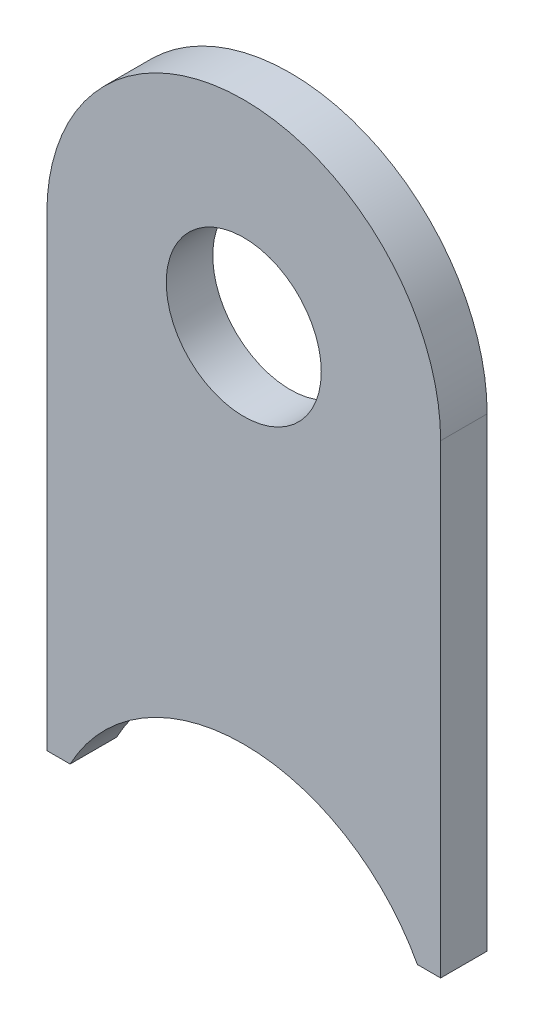
ISO-10303-21;
HEADER;
FILE_DESCRIPTION(('STEP AP214'),'2;1');
FILE_NAME('part.step','',(''),(''),'','','');
FILE_SCHEMA(('AUTOMOTIVE_DESIGN { 1 0 10303 214 1 1 1 1 }'));
ENDSEC;
DATA;
#1=APPLICATION_CONTEXT('core data for automotive mechanical design processes');
#2=APPLICATION_PROTOCOL_DEFINITION('international standard','automotive_design',2000,#1);
#3=PRODUCT_CONTEXT('',#1,'mechanical');
#4=PRODUCT('Part','Part','',(#3));
#5=PRODUCT_RELATED_PRODUCT_CATEGORY('part','',(#4));
#6=PRODUCT_DEFINITION_FORMATION('','',#4);
#7=PRODUCT_DEFINITION_CONTEXT('part definition',#1,'design');
#8=PRODUCT_DEFINITION('design','',#6,#7);
#9=PRODUCT_DEFINITION_SHAPE('','',#8);
#10=(LENGTH_UNIT() NAMED_UNIT(*) SI_UNIT(.MILLI.,.METRE.));
#11=(NAMED_UNIT(*) PLANE_ANGLE_UNIT() SI_UNIT($,.RADIAN.));
#12=(NAMED_UNIT(*) SI_UNIT($,.STERADIAN.) SOLID_ANGLE_UNIT());
#13=UNCERTAINTY_MEASURE_WITH_UNIT(LENGTH_MEASURE(1.E-05),#10,'distance_accuracy_value','');
#14=(GEOMETRIC_REPRESENTATION_CONTEXT(3) GLOBAL_UNCERTAINTY_ASSIGNED_CONTEXT((#13)) GLOBAL_UNIT_ASSIGNED_CONTEXT((#10,
#11,#12)) REPRESENTATION_CONTEXT('',''));
#15=CARTESIAN_POINT('',(0.,0.,0.));
#16=DIRECTION('',(0.,0.,1.));
#17=DIRECTION('',(1.,0.,0.));
#18=AXIS2_PLACEMENT_3D('',#15,#16,#17);
#19=CARTESIAN_POINT('',(0.,0.,-1.5));
#20=DIRECTION('',(0.,0.,1.));
#21=DIRECTION('',(1.,0.,0.));
#22=AXIS2_PLACEMENT_3D('',#19,#20,#21);
#23=CYLINDRICAL_SURFACE('',#22,12.7);
#24=DIRECTION('',(0.,0.,1.));
#25=VECTOR('',#24,1.);
#26=CARTESIAN_POINT('',(-12.7,0.,-1.5));
#27=LINE('',#26,#25);
#28=CARTESIAN_POINT('',(-12.7,0.,-1.5));
#29=VERTEX_POINT('',#28);
#30=CARTESIAN_POINT('',(-12.7,0.,1.5));
#31=VERTEX_POINT('',#30);
#32=EDGE_CURVE('E36',#29,#31,#27,.T.);
#33=ORIENTED_EDGE('',*,*,#32,.T.);
#34=CARTESIAN_POINT('',(0.,0.,1.5));
#35=DIRECTION('',(0.,0.,1.));
#36=DIRECTION('',(-1.,0.,0.));
#37=AXIS2_PLACEMENT_3D('',#34,#35,#36);
#38=CIRCLE('',#37,12.7);
#39=CARTESIAN_POINT('',(12.7,0.,1.5));
#40=VERTEX_POINT('',#39);
#41=EDGE_CURVE('E85',#40,#31,#38,.T.);
#42=ORIENTED_EDGE('',*,*,#41,.F.);
#43=DIRECTION('',(0.,0.,1.));
#44=VECTOR('',#43,1.);
#45=CARTESIAN_POINT('',(12.7,0.,-1.5));
#46=LINE('',#45,#44);
#47=CARTESIAN_POINT('',(12.7,0.,-1.5));
#48=VERTEX_POINT('',#47);
#49=EDGE_CURVE('E12',#48,#40,#46,.T.);
#50=ORIENTED_EDGE('',*,*,#49,.F.);
#51=CARTESIAN_POINT('',(0.,0.,-1.5));
#52=DIRECTION('',(0.,0.,1.));
#53=DIRECTION('',(-1.,0.,0.));
#54=AXIS2_PLACEMENT_3D('',#51,#52,#53);
#55=CIRCLE('',#54,12.7);
#56=EDGE_CURVE('E86',#48,#29,#55,.T.);
#57=ORIENTED_EDGE('',*,*,#56,.T.);
#58=EDGE_LOOP('',(#33,#42,#50,#57));
#59=FACE_BOUND('',#58,.T.);
#60=ADVANCED_FACE('F33',(#59),#23,.T.);
#61=CARTESIAN_POINT('',(12.7,0.,-1.5));
#62=DIRECTION('',(1.,0.,0.));
#63=DIRECTION('',(0.,1.,0.));
#64=AXIS2_PLACEMENT_3D('',#61,#62,#63);
#65=PLANE('',#64);
#66=ORIENTED_EDGE('',*,*,#49,.T.);
#67=DIRECTION('',(0.,1.,0.));
#68=VECTOR('',#67,1.);
#69=CARTESIAN_POINT('',(12.7,0.,1.5));
#70=LINE('',#69,#68);
#71=CARTESIAN_POINT('',(12.7,-30.0125130480309,1.5));
#72=VERTEX_POINT('',#71);
#73=EDGE_CURVE('E104',#72,#40,#70,.T.);
#74=ORIENTED_EDGE('',*,*,#73,.F.);
#75=DIRECTION('',(0.,0.,1.));
#76=VECTOR('',#75,1.);
#77=CARTESIAN_POINT('',(12.7,-30.0125130480309,-1.5));
#78=LINE('',#77,#76);
#79=CARTESIAN_POINT('',(12.7,-30.0125130480309,-1.5));
#80=VERTEX_POINT('',#79);
#81=EDGE_CURVE('E41',#80,#72,#78,.T.);
#82=ORIENTED_EDGE('',*,*,#81,.F.);
#83=DIRECTION('',(0.,1.,0.));
#84=VECTOR('',#83,1.);
#85=CARTESIAN_POINT('',(12.7,0.,-1.5));
#86=LINE('',#85,#84);
#87=EDGE_CURVE('E91',#80,#48,#86,.T.);
#88=ORIENTED_EDGE('',*,*,#87,.T.);
#89=EDGE_LOOP('',(#66,#74,#82,#88));
#90=FACE_BOUND('',#89,.T.);
#91=ADVANCED_FACE('F161',(#90),#65,.T.);
#92=CARTESIAN_POINT('',(11.2,-30.0125130480309,-1.5));
#93=DIRECTION('',(0.,-1.,0.));
#94=DIRECTION('',(0.,0.,-1.));
#95=AXIS2_PLACEMENT_3D('',#92,#93,#94);
#96=PLANE('',#95);
#97=ORIENTED_EDGE('',*,*,#81,.T.);
#98=DIRECTION('',(1.,0.,0.));
#99=VECTOR('',#98,1.);
#100=CARTESIAN_POINT('',(11.2,-30.0125130480309,1.5));
#101=LINE('',#100,#99);
#102=CARTESIAN_POINT('',(11.2,-30.0125130480309,1.5));
#103=VERTEX_POINT('',#102);
#104=EDGE_CURVE('E123',#103,#72,#101,.T.);
#105=ORIENTED_EDGE('',*,*,#104,.F.);
#106=DIRECTION('',(0.,0.,1.));
#107=VECTOR('',#106,1.);
#108=CARTESIAN_POINT('',(11.2,-30.0125130480309,-1.5));
#109=LINE('',#108,#107);
#110=CARTESIAN_POINT('',(11.2,-30.0125130480309,-1.5));
#111=VERTEX_POINT('',#110);
#112=EDGE_CURVE('E144',#111,#103,#109,.T.);
#113=ORIENTED_EDGE('',*,*,#112,.F.);
#114=DIRECTION('',(1.,0.,0.));
#115=VECTOR('',#114,1.);
#116=CARTESIAN_POINT('',(11.2,-30.0125130480309,-1.5));
#117=LINE('',#116,#115);
#118=EDGE_CURVE('E140',#111,#80,#117,.T.);
#119=ORIENTED_EDGE('',*,*,#118,.T.);
#120=EDGE_LOOP('',(#97,#105,#113,#119));
#121=FACE_BOUND('',#120,.T.);
#122=ADVANCED_FACE('F157',(#121),#96,.T.);
#123=CARTESIAN_POINT('',(0.,-36.,-1.5));
#124=DIRECTION('',(0.,0.,1.));
#125=DIRECTION('',(1.,0.,0.));
#126=AXIS2_PLACEMENT_3D('',#123,#124,#125);
#127=CYLINDRICAL_SURFACE('',#126,12.7);
#128=ORIENTED_EDGE('',*,*,#112,.T.);
#129=CARTESIAN_POINT('',(0.,-36.,1.5));
#130=DIRECTION('',(0.,0.,-1.));
#131=DIRECTION('',(-1.,0.,0.));
#132=AXIS2_PLACEMENT_3D('',#129,#130,#131);
#133=CIRCLE('',#132,12.7);
#134=CARTESIAN_POINT('',(-11.2,-30.0125130480309,1.5));
#135=VERTEX_POINT('',#134);
#136=EDGE_CURVE('E119',#135,#103,#133,.T.);
#137=ORIENTED_EDGE('',*,*,#136,.F.);
#138=DIRECTION('',(0.,0.,1.));
#139=VECTOR('',#138,1.);
#140=CARTESIAN_POINT('',(-11.2,-30.0125130480309,-1.5));
#141=LINE('',#140,#139);
#142=CARTESIAN_POINT('',(-11.2,-30.0125130480309,-1.5));
#143=VERTEX_POINT('',#142);
#144=EDGE_CURVE('E146',#143,#135,#141,.T.);
#145=ORIENTED_EDGE('',*,*,#144,.F.);
#146=CARTESIAN_POINT('',(0.,-36.,-1.5));
#147=DIRECTION('',(0.,0.,-1.));
#148=DIRECTION('',(-1.,0.,0.));
#149=AXIS2_PLACEMENT_3D('',#146,#147,#148);
#150=CIRCLE('',#149,12.7);
#151=EDGE_CURVE('E137',#143,#111,#150,.T.);
#152=ORIENTED_EDGE('',*,*,#151,.T.);
#153=EDGE_LOOP('',(#128,#137,#145,#152));
#154=FACE_BOUND('',#153,.T.);
#155=ADVANCED_FACE('F154',(#154),#127,.F.);
#156=CARTESIAN_POINT('',(-12.7,-30.0125130480309,-1.5));
#157=DIRECTION('',(0.,-1.,0.));
#158=DIRECTION('',(0.,0.,-1.));
#159=AXIS2_PLACEMENT_3D('',#156,#157,#158);
#160=PLANE('',#159);
#161=ORIENTED_EDGE('',*,*,#144,.T.);
#162=DIRECTION('',(1.,0.,0.));
#163=VECTOR('',#162,1.);
#164=CARTESIAN_POINT('',(-12.7,-30.0125130480309,1.5));
#165=LINE('',#164,#163);
#166=CARTESIAN_POINT('',(-12.7,-30.0125130480309,1.5));
#167=VERTEX_POINT('',#166);
#168=EDGE_CURVE('E98',#167,#135,#165,.T.);
#169=ORIENTED_EDGE('',*,*,#168,.F.);
#170=DIRECTION('',(0.,0.,1.));
#171=VECTOR('',#170,1.);
#172=CARTESIAN_POINT('',(-12.7,-30.0125130480309,-1.5));
#173=LINE('',#172,#171);
#174=CARTESIAN_POINT('',(-12.7,-30.0125130480309,-1.5));
#175=VERTEX_POINT('',#174);
#176=EDGE_CURVE('E90',#175,#167,#173,.T.);
#177=ORIENTED_EDGE('',*,*,#176,.F.);
#178=DIRECTION('',(1.,0.,0.));
#179=VECTOR('',#178,1.);
#180=CARTESIAN_POINT('',(-12.7,-30.0125130480309,-1.5));
#181=LINE('',#180,#179);
#182=EDGE_CURVE('E134',#175,#143,#181,.T.);
#183=ORIENTED_EDGE('',*,*,#182,.T.);
#184=EDGE_LOOP('',(#161,#169,#177,#183));
#185=FACE_BOUND('',#184,.T.);
#186=ADVANCED_FACE('F148',(#185),#160,.T.);
#187=CARTESIAN_POINT('',(-12.7,0.,-1.5));
#188=DIRECTION('',(-1.,0.,0.));
#189=DIRECTION('',(0.,-1.,0.));
#190=AXIS2_PLACEMENT_3D('',#187,#188,#189);
#191=PLANE('',#190);
#192=ORIENTED_EDGE('',*,*,#176,.T.);
#193=DIRECTION('',(0.,-1.,0.));
#194=VECTOR('',#193,1.);
#195=CARTESIAN_POINT('',(-12.7,0.,1.5));
#196=LINE('',#195,#194);
#197=EDGE_CURVE('E93',#31,#167,#196,.T.);
#198=ORIENTED_EDGE('',*,*,#197,.F.);
#199=ORIENTED_EDGE('',*,*,#32,.F.);
#200=DIRECTION('',(0.,-1.,0.));
#201=VECTOR('',#200,1.);
#202=CARTESIAN_POINT('',(-12.7,0.,-1.5));
#203=LINE('',#202,#201);
#204=EDGE_CURVE('E132',#29,#175,#203,.T.);
#205=ORIENTED_EDGE('',*,*,#204,.T.);
#206=EDGE_LOOP('',(#192,#198,#199,#205));
#207=FACE_BOUND('',#206,.T.);
#208=ADVANCED_FACE('F94',(#207),#191,.T.);
#209=CARTESIAN_POINT('',(0.,0.,-1.5));
#210=DIRECTION('',(0.,0.,-1.));
#211=DIRECTION('',(-1.,0.,0.));
#212=AXIS2_PLACEMENT_3D('',#209,#210,#211);
#213=PLANE('',#212);
#214=CARTESIAN_POINT('',(0.,0.,-1.5));
#215=DIRECTION('',(0.,0.,1.));
#216=DIRECTION('',(1.,0.,0.));
#217=AXIS2_PLACEMENT_3D('',#214,#215,#216);
#218=CIRCLE('',#217,5.);
#219=CARTESIAN_POINT('',(5.,0.,-1.5));
#220=VERTEX_POINT('',#219);
#221=EDGE_CURVE('E128',#220,#220,#218,.T.);
#222=ORIENTED_EDGE('',*,*,#221,.T.);
#223=EDGE_LOOP('',(#222));
#224=FACE_BOUND('',#223,.T.);
#225=ORIENTED_EDGE('',*,*,#56,.F.);
#226=ORIENTED_EDGE('',*,*,#87,.F.);
#227=ORIENTED_EDGE('',*,*,#118,.F.);
#228=ORIENTED_EDGE('',*,*,#151,.F.);
#229=ORIENTED_EDGE('',*,*,#182,.F.);
#230=ORIENTED_EDGE('',*,*,#204,.F.);
#231=EDGE_LOOP('',(#225,#226,#227,#228,#229,#230));
#232=FACE_BOUND('',#231,.T.);
#233=ADVANCED_FACE('F160',(#224,#232),#213,.T.);
#234=CARTESIAN_POINT('',(0.,0.,-1.5));
#235=DIRECTION('',(0.,0.,1.));
#236=DIRECTION('',(1.,0.,0.));
#237=AXIS2_PLACEMENT_3D('',#234,#235,#236);
#238=CYLINDRICAL_SURFACE('',#237,5.);
#239=ORIENTED_EDGE('',*,*,#221,.F.);
#240=EDGE_LOOP('',(#239));
#241=FACE_BOUND('',#240,.T.);
#242=CARTESIAN_POINT('',(0.,0.,1.5));
#243=DIRECTION('',(0.,0.,1.));
#244=DIRECTION('',(1.,0.,0.));
#245=AXIS2_PLACEMENT_3D('',#242,#243,#244);
#246=CIRCLE('',#245,5.);
#247=CARTESIAN_POINT('',(5.,0.,1.5));
#248=VERTEX_POINT('',#247);
#249=EDGE_CURVE('E105',#248,#248,#246,.T.);
#250=ORIENTED_EDGE('',*,*,#249,.T.);
#251=EDGE_LOOP('',(#250));
#252=FACE_BOUND('',#251,.T.);
#253=ADVANCED_FACE('F179',(#241,#252),#238,.F.);
#254=CARTESIAN_POINT('',(0.,0.,1.5));
#255=DIRECTION('',(0.,0.,-1.));
#256=DIRECTION('',(-1.,0.,0.));
#257=AXIS2_PLACEMENT_3D('',#254,#255,#256);
#258=PLANE('',#257);
#259=ORIENTED_EDGE('',*,*,#41,.T.);
#260=ORIENTED_EDGE('',*,*,#197,.T.);
#261=ORIENTED_EDGE('',*,*,#168,.T.);
#262=ORIENTED_EDGE('',*,*,#136,.T.);
#263=ORIENTED_EDGE('',*,*,#104,.T.);
#264=ORIENTED_EDGE('',*,*,#73,.T.);
#265=EDGE_LOOP('',(#259,#260,#261,#262,#263,#264));
#266=FACE_BOUND('',#265,.T.);
#267=ORIENTED_EDGE('',*,*,#249,.F.);
#268=EDGE_LOOP('',(#267));
#269=FACE_BOUND('',#268,.T.);
#270=ADVANCED_FACE('F101',(#266,#269),#258,.F.);
#271=CLOSED_SHELL('',(#60,#91,#122,#155,#186,#208,#233,#253,#270));
#272=MANIFOLD_SOLID_BREP('B2',#271);
#273=ADVANCED_BREP_SHAPE_REPRESENTATION('',(#18,#272),#14);
#274=SHAPE_DEFINITION_REPRESENTATION(#9,#273);
ENDSEC;
END-ISO-10303-21;
